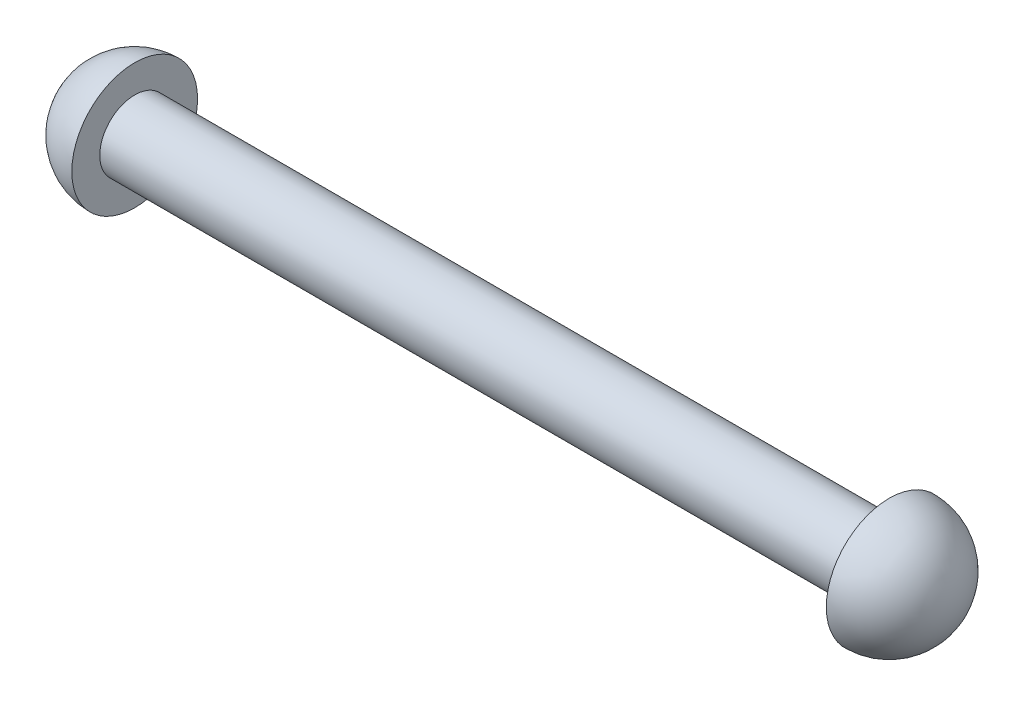
ISO-10303-21;
HEADER;
FILE_DESCRIPTION(('STEP AP214'),'2;1');
FILE_NAME('part.step','',(''),(''),'','','');
FILE_SCHEMA(('AUTOMOTIVE_DESIGN { 1 0 10303 214 1 1 1 1 }'));
ENDSEC;
DATA;
#1=APPLICATION_CONTEXT('core data for automotive mechanical design processes');
#2=APPLICATION_PROTOCOL_DEFINITION('international standard','automotive_design',2000,#1);
#3=PRODUCT_CONTEXT('',#1,'mechanical');
#4=PRODUCT('Part','Part','',(#3));
#5=PRODUCT_RELATED_PRODUCT_CATEGORY('part','',(#4));
#6=PRODUCT_DEFINITION_FORMATION('','',#4);
#7=PRODUCT_DEFINITION_CONTEXT('part definition',#1,'design');
#8=PRODUCT_DEFINITION('design','',#6,#7);
#9=PRODUCT_DEFINITION_SHAPE('','',#8);
#10=(LENGTH_UNIT() NAMED_UNIT(*) SI_UNIT(.MILLI.,.METRE.));
#11=(NAMED_UNIT(*) PLANE_ANGLE_UNIT() SI_UNIT($,.RADIAN.));
#12=(NAMED_UNIT(*) SI_UNIT($,.STERADIAN.) SOLID_ANGLE_UNIT());
#13=UNCERTAINTY_MEASURE_WITH_UNIT(LENGTH_MEASURE(1.E-05),#10,'distance_accuracy_value','');
#14=(GEOMETRIC_REPRESENTATION_CONTEXT(3) GLOBAL_UNCERTAINTY_ASSIGNED_CONTEXT((#13)) GLOBAL_UNIT_ASSIGNED_CONTEXT((#10,
#11,#12)) REPRESENTATION_CONTEXT('',''));
#15=CARTESIAN_POINT('',(0.,0.,0.));
#16=DIRECTION('',(0.,0.,1.));
#17=DIRECTION('',(1.,0.,0.));
#18=AXIS2_PLACEMENT_3D('',#15,#16,#17);
#19=CARTESIAN_POINT('',(34.29,0.,0.));
#20=DIRECTION('',(-1.,0.,0.));
#21=DIRECTION('',(0.,0.,-1.));
#22=AXIS2_PLACEMENT_3D('',#19,#20,#21);
#23=SPHERICAL_SURFACE('',#22,5.715);
#24=CARTESIAN_POINT('',(34.29,0.,0.));
#25=DIRECTION('',(-1.,0.,0.));
#26=DIRECTION('',(0.,0.,1.));
#27=AXIS2_PLACEMENT_3D('',#24,#25,#26);
#28=CIRCLE('',#27,5.715);
#29=CARTESIAN_POINT('',(34.29,0.,5.715));
#30=VERTEX_POINT('',#29);
#31=EDGE_CURVE('E60',#30,#30,#28,.T.);
#32=ORIENTED_EDGE('',*,*,#31,.F.);
#33=EDGE_LOOP('',(#32));
#34=FACE_BOUND('',#33,.T.);
#35=ADVANCED_FACE('F43',(#34),#23,.T.);
#36=CARTESIAN_POINT('',(34.29,0.,0.));
#37=DIRECTION('',(-1.,0.,0.));
#38=DIRECTION('',(0.,0.,1.));
#39=AXIS2_PLACEMENT_3D('',#36,#37,#38);
#40=PLANE('',#39);
#41=ORIENTED_EDGE('',*,*,#31,.T.);
#42=EDGE_LOOP('',(#41));
#43=FACE_BOUND('',#42,.T.);
#44=CARTESIAN_POINT('',(34.29,0.,0.));
#45=DIRECTION('',(-1.,0.,0.));
#46=DIRECTION('',(0.,0.,1.));
#47=AXIS2_PLACEMENT_3D('',#44,#45,#46);
#48=CIRCLE('',#47,3.175);
#49=CARTESIAN_POINT('',(34.29,0.,3.175));
#50=VERTEX_POINT('',#49);
#51=EDGE_CURVE('E55',#50,#50,#48,.T.);
#52=ORIENTED_EDGE('',*,*,#51,.F.);
#53=EDGE_LOOP('',(#52));
#54=FACE_BOUND('',#53,.T.);
#55=ADVANCED_FACE('F67',(#43,#54),#40,.T.);
#56=CARTESIAN_POINT('',(-40.005,0.,0.));
#57=DIRECTION('',(-1.,0.,0.));
#58=DIRECTION('',(0.,0.,1.));
#59=AXIS2_PLACEMENT_3D('',#56,#57,#58);
#60=CYLINDRICAL_SURFACE('',#59,3.175);
#61=ORIENTED_EDGE('',*,*,#51,.T.);
#62=EDGE_LOOP('',(#61));
#63=FACE_BOUND('',#62,.T.);
#64=CARTESIAN_POINT('',(-34.29,0.,0.));
#65=DIRECTION('',(-1.,0.,0.));
#66=DIRECTION('',(0.,0.,1.));
#67=AXIS2_PLACEMENT_3D('',#64,#65,#66);
#68=CIRCLE('',#67,3.175);
#69=CARTESIAN_POINT('',(-34.29,0.,3.175));
#70=VERTEX_POINT('',#69);
#71=EDGE_CURVE('E50',#70,#70,#68,.T.);
#72=ORIENTED_EDGE('',*,*,#71,.F.);
#73=EDGE_LOOP('',(#72));
#74=FACE_BOUND('',#73,.T.);
#75=ADVANCED_FACE('F71',(#63,#74),#60,.T.);
#76=CARTESIAN_POINT('',(-34.29,0.,0.));
#77=DIRECTION('',(-1.,0.,0.));
#78=DIRECTION('',(0.,0.,1.));
#79=AXIS2_PLACEMENT_3D('',#76,#77,#78);
#80=PLANE('',#79);
#81=CARTESIAN_POINT('',(-34.29,0.,0.));
#82=DIRECTION('',(-1.,0.,0.));
#83=DIRECTION('',(0.,0.,1.));
#84=AXIS2_PLACEMENT_3D('',#81,#82,#83);
#85=CIRCLE('',#84,5.715);
#86=CARTESIAN_POINT('',(-34.29,0.,5.715));
#87=VERTEX_POINT('',#86);
#88=EDGE_CURVE('E10',#87,#87,#85,.T.);
#89=ORIENTED_EDGE('',*,*,#88,.F.);
#90=EDGE_LOOP('',(#89));
#91=FACE_BOUND('',#90,.T.);
#92=ORIENTED_EDGE('',*,*,#71,.T.);
#93=EDGE_LOOP('',(#92));
#94=FACE_BOUND('',#93,.T.);
#95=ADVANCED_FACE('F77',(#91,#94),#80,.F.);
#96=CARTESIAN_POINT('',(-34.29,0.,0.));
#97=DIRECTION('',(-1.,0.,0.));
#98=DIRECTION('',(0.,0.,-1.));
#99=AXIS2_PLACEMENT_3D('',#96,#97,#98);
#100=SPHERICAL_SURFACE('',#99,5.715);
#101=ORIENTED_EDGE('',*,*,#88,.T.);
#102=EDGE_LOOP('',(#101));
#103=FACE_BOUND('',#102,.T.);
#104=ADVANCED_FACE('F83',(#103),#100,.T.);
#105=CLOSED_SHELL('',(#35,#55,#75,#95,#104));
#106=MANIFOLD_SOLID_BREP('B2',#105);
#107=ADVANCED_BREP_SHAPE_REPRESENTATION('',(#18,#106),#14);
#108=SHAPE_DEFINITION_REPRESENTATION(#9,#107);
ENDSEC;
END-ISO-10303-21;
